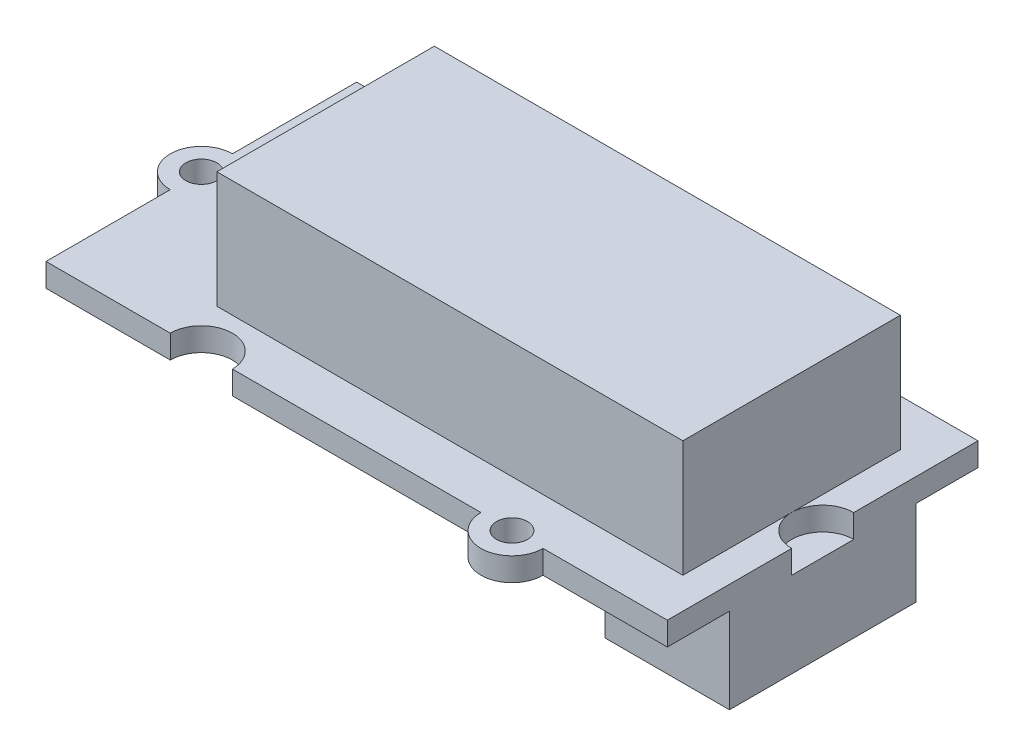
ISO-10303-21;
HEADER;
FILE_DESCRIPTION(('STEP AP214'),'2;1');
FILE_NAME('part.step','',(''),(''),'','','');
FILE_SCHEMA(('AUTOMOTIVE_DESIGN { 1 0 10303 214 1 1 1 1 }'));
ENDSEC;
DATA;
#1=APPLICATION_CONTEXT('core data for automotive mechanical design processes');
#2=APPLICATION_PROTOCOL_DEFINITION('international standard','automotive_design',2000,#1);
#3=PRODUCT_CONTEXT('',#1,'mechanical');
#4=PRODUCT('Part','Part','',(#3));
#5=PRODUCT_RELATED_PRODUCT_CATEGORY('part','',(#4));
#6=PRODUCT_DEFINITION_FORMATION('','',#4);
#7=PRODUCT_DEFINITION_CONTEXT('part definition',#1,'design');
#8=PRODUCT_DEFINITION('design','',#6,#7);
#9=PRODUCT_DEFINITION_SHAPE('','',#8);
#10=(LENGTH_UNIT() NAMED_UNIT(*) SI_UNIT(.MILLI.,.METRE.));
#11=(NAMED_UNIT(*) PLANE_ANGLE_UNIT() SI_UNIT($,.RADIAN.));
#12=(NAMED_UNIT(*) SI_UNIT($,.STERADIAN.) SOLID_ANGLE_UNIT());
#13=UNCERTAINTY_MEASURE_WITH_UNIT(LENGTH_MEASURE(1.E-05),#10,'distance_accuracy_value','');
#14=(GEOMETRIC_REPRESENTATION_CONTEXT(3) GLOBAL_UNCERTAINTY_ASSIGNED_CONTEXT((#13)) GLOBAL_UNIT_ASSIGNED_CONTEXT((#10,
#11,#12)) REPRESENTATION_CONTEXT('',''));
#15=CARTESIAN_POINT('',(0.,0.,0.));
#16=DIRECTION('',(0.,0.,1.));
#17=DIRECTION('',(1.,0.,0.));
#18=AXIS2_PLACEMENT_3D('',#15,#16,#17);
#19=CARTESIAN_POINT('',(20.,0.,0.));
#20=DIRECTION('',(0.,1.,0.));
#21=DIRECTION('',(0.,0.,1.));
#22=AXIS2_PLACEMENT_3D('',#19,#20,#21);
#23=PLANE('',#22);
#24=CARTESIAN_POINT('',(10.,0.,-10.));
#25=DIRECTION('',(0.,1.,0.));
#26=DIRECTION('',(0.,0.,1.));
#27=AXIS2_PLACEMENT_3D('',#24,#25,#26);
#28=CIRCLE('',#27,1.);
#29=CARTESIAN_POINT('',(10.,0.,-9.));
#30=VERTEX_POINT('',#29);
#31=EDGE_CURVE('E278',#30,#30,#28,.T.);
#32=ORIENTED_EDGE('',*,*,#31,.T.);
#33=EDGE_LOOP('',(#32));
#34=FACE_BOUND('',#33,.T.);
#35=CARTESIAN_POINT('',(10.,0.,10.));
#36=DIRECTION('',(0.,1.,0.));
#37=DIRECTION('',(0.,0.,1.));
#38=AXIS2_PLACEMENT_3D('',#35,#36,#37);
#39=CIRCLE('',#38,1.);
#40=CARTESIAN_POINT('',(10.,0.,11.));
#41=VERTEX_POINT('',#40);
#42=EDGE_CURVE('E283',#41,#41,#39,.T.);
#43=ORIENTED_EDGE('',*,*,#42,.T.);
#44=EDGE_LOOP('',(#43));
#45=FACE_BOUND('',#44,.T.);
#46=CARTESIAN_POINT('',(-20.,0.,0.));
#47=DIRECTION('',(0.,1.,0.));
#48=DIRECTION('',(0.,0.,1.));
#49=AXIS2_PLACEMENT_3D('',#46,#47,#48);
#50=CIRCLE('',#49,1.);
#51=CARTESIAN_POINT('',(-20.,0.,1.));
#52=VERTEX_POINT('',#51);
#53=EDGE_CURVE('E291',#52,#52,#50,.T.);
#54=ORIENTED_EDGE('',*,*,#53,.T.);
#55=EDGE_LOOP('',(#54));
#56=FACE_BOUND('',#55,.T.);
#57=DIRECTION('',(-1.,0.,0.));
#58=VECTOR('',#57,1.);
#59=CARTESIAN_POINT('',(12.,0.,6.));
#60=LINE('',#59,#58);
#61=CARTESIAN_POINT('',(20.,0.,6.));
#62=VERTEX_POINT('',#61);
#63=CARTESIAN_POINT('',(12.,0.,6.));
#64=VERTEX_POINT('',#63);
#65=EDGE_CURVE('E225',#62,#64,#60,.T.);
#66=ORIENTED_EDGE('',*,*,#65,.F.);
#67=DIRECTION('',(0.,0.,-1.));
#68=VECTOR('',#67,1.);
#69=CARTESIAN_POINT('',(20.,0.,2.));
#70=LINE('',#69,#68);
#71=CARTESIAN_POINT('',(20.,0.,10.));
#72=VERTEX_POINT('',#71);
#73=EDGE_CURVE('E359',#72,#62,#70,.T.);
#74=ORIENTED_EDGE('',*,*,#73,.F.);
#75=DIRECTION('',(1.,0.,0.));
#76=VECTOR('',#75,1.);
#77=CARTESIAN_POINT('',(12.,0.,10.));
#78=LINE('',#77,#76);
#79=CARTESIAN_POINT('',(12.,0.,10.));
#80=VERTEX_POINT('',#79);
#81=EDGE_CURVE('E299',#80,#72,#78,.T.);
#82=ORIENTED_EDGE('',*,*,#81,.F.);
#83=CARTESIAN_POINT('',(10.,0.,10.));
#84=DIRECTION('',(0.,1.,0.));
#85=DIRECTION('',(0.,0.,1.));
#86=AXIS2_PLACEMENT_3D('',#83,#84,#85);
#87=CIRCLE('',#86,2.);
#88=CARTESIAN_POINT('',(8.00000000000001,0.,10.));
#89=VERTEX_POINT('',#88);
#90=EDGE_CURVE('E308',#89,#80,#87,.T.);
#91=ORIENTED_EDGE('',*,*,#90,.F.);
#92=DIRECTION('',(1.,0.,0.));
#93=VECTOR('',#92,1.);
#94=CARTESIAN_POINT('',(-7.99999999999999,0.,10.));
#95=LINE('',#94,#93);
#96=CARTESIAN_POINT('',(-7.99999999999999,0.,10.));
#97=VERTEX_POINT('',#96);
#98=EDGE_CURVE('E399',#97,#89,#95,.T.);
#99=ORIENTED_EDGE('',*,*,#98,.F.);
#100=CARTESIAN_POINT('',(-9.99999999999999,0.,10.));
#101=DIRECTION('',(0.,-1.,0.));
#102=DIRECTION('',(0.,0.,1.));
#103=AXIS2_PLACEMENT_3D('',#100,#101,#102);
#104=CIRCLE('',#103,2.);
#105=CARTESIAN_POINT('',(-12.,0.,10.));
#106=VERTEX_POINT('',#105);
#107=EDGE_CURVE('E396',#106,#97,#104,.T.);
#108=ORIENTED_EDGE('',*,*,#107,.F.);
#109=DIRECTION('',(1.,0.,0.));
#110=VECTOR('',#109,1.);
#111=CARTESIAN_POINT('',(-20.,0.,10.));
#112=LINE('',#111,#110);
#113=CARTESIAN_POINT('',(-20.,0.,10.));
#114=VERTEX_POINT('',#113);
#115=EDGE_CURVE('E393',#114,#106,#112,.T.);
#116=ORIENTED_EDGE('',*,*,#115,.F.);
#117=DIRECTION('',(0.,0.,1.));
#118=VECTOR('',#117,1.);
#119=CARTESIAN_POINT('',(-20.,0.,2.));
#120=LINE('',#119,#118);
#121=CARTESIAN_POINT('',(-20.,0.,2.));
#122=VERTEX_POINT('',#121);
#123=EDGE_CURVE('E390',#122,#114,#120,.T.);
#124=ORIENTED_EDGE('',*,*,#123,.F.);
#125=CARTESIAN_POINT('',(-20.,0.,0.));
#126=DIRECTION('',(0.,1.,0.));
#127=DIRECTION('',(0.,0.,1.));
#128=AXIS2_PLACEMENT_3D('',#125,#126,#127);
#129=CIRCLE('',#128,2.);
#130=CARTESIAN_POINT('',(-20.,0.,-2.));
#131=VERTEX_POINT('',#130);
#132=EDGE_CURVE('E387',#131,#122,#129,.T.);
#133=ORIENTED_EDGE('',*,*,#132,.F.);
#134=DIRECTION('',(0.,0.,1.));
#135=VECTOR('',#134,1.);
#136=CARTESIAN_POINT('',(-20.,0.,-10.));
#137=LINE('',#136,#135);
#138=CARTESIAN_POINT('',(-20.,0.,-10.));
#139=VERTEX_POINT('',#138);
#140=EDGE_CURVE('E384',#139,#131,#137,.T.);
#141=ORIENTED_EDGE('',*,*,#140,.F.);
#142=DIRECTION('',(-1.,0.,0.));
#143=VECTOR('',#142,1.);
#144=CARTESIAN_POINT('',(-20.,0.,-10.));
#145=LINE('',#144,#143);
#146=CARTESIAN_POINT('',(-12.,0.,-10.));
#147=VERTEX_POINT('',#146);
#148=EDGE_CURVE('E381',#147,#139,#145,.T.);
#149=ORIENTED_EDGE('',*,*,#148,.F.);
#150=CARTESIAN_POINT('',(-9.99999999999999,0.,-10.));
#151=DIRECTION('',(0.,-1.,0.));
#152=DIRECTION('',(0.,0.,1.));
#153=AXIS2_PLACEMENT_3D('',#150,#151,#152);
#154=CIRCLE('',#153,2.);
#155=CARTESIAN_POINT('',(-7.99999999999999,0.,-10.));
#156=VERTEX_POINT('',#155);
#157=EDGE_CURVE('E378',#156,#147,#154,.T.);
#158=ORIENTED_EDGE('',*,*,#157,.F.);
#159=DIRECTION('',(-1.,0.,0.));
#160=VECTOR('',#159,1.);
#161=CARTESIAN_POINT('',(-7.99999999999999,0.,-10.));
#162=LINE('',#161,#160);
#163=CARTESIAN_POINT('',(8.00000000000001,0.,-10.));
#164=VERTEX_POINT('',#163);
#165=EDGE_CURVE('E375',#164,#156,#162,.T.);
#166=ORIENTED_EDGE('',*,*,#165,.F.);
#167=CARTESIAN_POINT('',(10.,0.,-10.));
#168=DIRECTION('',(0.,1.,0.));
#169=DIRECTION('',(0.,0.,1.));
#170=AXIS2_PLACEMENT_3D('',#167,#168,#169);
#171=CIRCLE('',#170,2.);
#172=CARTESIAN_POINT('',(12.,0.,-10.));
#173=VERTEX_POINT('',#172);
#174=EDGE_CURVE('E372',#173,#164,#171,.T.);
#175=ORIENTED_EDGE('',*,*,#174,.F.);
#176=DIRECTION('',(-1.,0.,0.));
#177=VECTOR('',#176,1.);
#178=CARTESIAN_POINT('',(12.,0.,-10.));
#179=LINE('',#178,#177);
#180=CARTESIAN_POINT('',(20.,0.,-10.));
#181=VERTEX_POINT('',#180);
#182=EDGE_CURVE('E369',#181,#173,#179,.T.);
#183=ORIENTED_EDGE('',*,*,#182,.F.);
#184=DIRECTION('',(0.,0.,-1.));
#185=VECTOR('',#184,1.);
#186=CARTESIAN_POINT('',(20.,0.,-10.));
#187=LINE('',#186,#185);
#188=CARTESIAN_POINT('',(20.,0.,-6.));
#189=VERTEX_POINT('',#188);
#190=EDGE_CURVE('E366',#189,#181,#187,.T.);
#191=ORIENTED_EDGE('',*,*,#190,.F.);
#192=DIRECTION('',(1.,0.,0.));
#193=VECTOR('',#192,1.);
#194=CARTESIAN_POINT('',(12.,0.,-6.));
#195=LINE('',#194,#193);
#196=CARTESIAN_POINT('',(12.,0.,-6.));
#197=VERTEX_POINT('',#196);
#198=EDGE_CURVE('E62',#197,#189,#195,.T.);
#199=ORIENTED_EDGE('',*,*,#198,.F.);
#200=DIRECTION('',(0.,0.,-1.));
#201=VECTOR('',#200,1.);
#202=CARTESIAN_POINT('',(12.,0.,6.));
#203=LINE('',#202,#201);
#204=EDGE_CURVE('E57',#64,#197,#203,.T.);
#205=ORIENTED_EDGE('',*,*,#204,.F.);
#206=EDGE_LOOP('',(#66,#74,#82,#91,#99,#108,#116,#124,#133,#141,#149,#158,#166,#175,#183,#191,
#199,#205));
#207=FACE_BOUND('',#206,.T.);
#208=ADVANCED_FACE('F39',(#34,#45,#56,#207),#23,.F.);
#209=CARTESIAN_POINT('',(20.,1.5,0.));
#210=DIRECTION('',(0.,1.,0.));
#211=DIRECTION('',(0.,0.,1.));
#212=AXIS2_PLACEMENT_3D('',#209,#210,#211);
#213=PLANE('',#212);
#214=DIRECTION('',(0.,0.,-1.));
#215=VECTOR('',#214,1.);
#216=CARTESIAN_POINT('',(18.,1.5,-7.));
#217=LINE('',#216,#215);
#218=CARTESIAN_POINT('',(18.,1.5,7.));
#219=VERTEX_POINT('',#218);
#220=CARTESIAN_POINT('',(18.,1.5,0.));
#221=VERTEX_POINT('',#220);
#222=EDGE_CURVE('E50',#219,#221,#217,.T.);
#223=ORIENTED_EDGE('',*,*,#222,.F.);
#224=DIRECTION('',(1.,0.,0.));
#225=VECTOR('',#224,1.);
#226=CARTESIAN_POINT('',(18.,1.5,7.));
#227=LINE('',#226,#225);
#228=CARTESIAN_POINT('',(-12.,1.5,7.));
#229=VERTEX_POINT('',#228);
#230=EDGE_CURVE('E243',#229,#219,#227,.T.);
#231=ORIENTED_EDGE('',*,*,#230,.F.);
#232=DIRECTION('',(0.,0.,1.));
#233=VECTOR('',#232,1.);
#234=CARTESIAN_POINT('',(-12.,1.5,-7.));
#235=LINE('',#234,#233);
#236=CARTESIAN_POINT('',(-12.,1.5,-7.));
#237=VERTEX_POINT('',#236);
#238=EDGE_CURVE('E256',#237,#229,#235,.T.);
#239=ORIENTED_EDGE('',*,*,#238,.F.);
#240=DIRECTION('',(-1.,0.,0.));
#241=VECTOR('',#240,1.);
#242=CARTESIAN_POINT('',(18.,1.5,-7.));
#243=LINE('',#242,#241);
#244=CARTESIAN_POINT('',(18.,1.5,-7.));
#245=VERTEX_POINT('',#244);
#246=EDGE_CURVE('E233',#245,#237,#243,.T.);
#247=ORIENTED_EDGE('',*,*,#246,.F.);
#248=EDGE_CURVE('E11',#221,#245,#217,.T.);
#249=ORIENTED_EDGE('',*,*,#248,.F.);
#250=CARTESIAN_POINT('',(20.,1.5,0.));
#251=DIRECTION('',(0.,-1.,0.));
#252=DIRECTION('',(0.,0.,1.));
#253=AXIS2_PLACEMENT_3D('',#250,#251,#252);
#254=CIRCLE('',#253,2.);
#255=CARTESIAN_POINT('',(20.,1.5,-2.));
#256=VERTEX_POINT('',#255);
#257=EDGE_CURVE('E311',#221,#256,#254,.T.);
#258=ORIENTED_EDGE('',*,*,#257,.T.);
#259=DIRECTION('',(0.,0.,-1.));
#260=VECTOR('',#259,1.);
#261=CARTESIAN_POINT('',(20.,1.5,-10.));
#262=LINE('',#261,#260);
#263=CARTESIAN_POINT('',(20.,1.5,-10.));
#264=VERTEX_POINT('',#263);
#265=EDGE_CURVE('E316',#256,#264,#262,.T.);
#266=ORIENTED_EDGE('',*,*,#265,.T.);
#267=DIRECTION('',(-1.,0.,0.));
#268=VECTOR('',#267,1.);
#269=CARTESIAN_POINT('',(12.,1.5,-10.));
#270=LINE('',#269,#268);
#271=CARTESIAN_POINT('',(12.,1.5,-10.));
#272=VERTEX_POINT('',#271);
#273=EDGE_CURVE('E319',#264,#272,#270,.T.);
#274=ORIENTED_EDGE('',*,*,#273,.T.);
#275=CARTESIAN_POINT('',(10.,1.5,-10.));
#276=DIRECTION('',(0.,1.,0.));
#277=DIRECTION('',(0.,0.,1.));
#278=AXIS2_PLACEMENT_3D('',#275,#276,#277);
#279=CIRCLE('',#278,2.);
#280=CARTESIAN_POINT('',(8.00000000000001,1.5,-10.));
#281=VERTEX_POINT('',#280);
#282=EDGE_CURVE('E322',#272,#281,#279,.T.);
#283=ORIENTED_EDGE('',*,*,#282,.T.);
#284=DIRECTION('',(-1.,0.,0.));
#285=VECTOR('',#284,1.);
#286=CARTESIAN_POINT('',(-7.99999999999999,1.5,-10.));
#287=LINE('',#286,#285);
#288=CARTESIAN_POINT('',(-7.99999999999999,1.5,-10.));
#289=VERTEX_POINT('',#288);
#290=EDGE_CURVE('E325',#281,#289,#287,.T.);
#291=ORIENTED_EDGE('',*,*,#290,.T.);
#292=CARTESIAN_POINT('',(-9.99999999999999,1.5,-10.));
#293=DIRECTION('',(0.,-1.,0.));
#294=DIRECTION('',(0.,0.,1.));
#295=AXIS2_PLACEMENT_3D('',#292,#293,#294);
#296=CIRCLE('',#295,2.);
#297=CARTESIAN_POINT('',(-12.,1.5,-10.));
#298=VERTEX_POINT('',#297);
#299=EDGE_CURVE('E328',#289,#298,#296,.T.);
#300=ORIENTED_EDGE('',*,*,#299,.T.);
#301=DIRECTION('',(-1.,0.,0.));
#302=VECTOR('',#301,1.);
#303=CARTESIAN_POINT('',(-20.,1.5,-10.));
#304=LINE('',#303,#302);
#305=CARTESIAN_POINT('',(-20.,1.5,-10.));
#306=VERTEX_POINT('',#305);
#307=EDGE_CURVE('E331',#298,#306,#304,.T.);
#308=ORIENTED_EDGE('',*,*,#307,.T.);
#309=DIRECTION('',(0.,0.,1.));
#310=VECTOR('',#309,1.);
#311=CARTESIAN_POINT('',(-20.,1.5,-10.));
#312=LINE('',#311,#310);
#313=CARTESIAN_POINT('',(-20.,1.5,-2.));
#314=VERTEX_POINT('',#313);
#315=EDGE_CURVE('E334',#306,#314,#312,.T.);
#316=ORIENTED_EDGE('',*,*,#315,.T.);
#317=CARTESIAN_POINT('',(-20.,1.5,0.));
#318=DIRECTION('',(0.,1.,0.));
#319=DIRECTION('',(0.,0.,1.));
#320=AXIS2_PLACEMENT_3D('',#317,#318,#319);
#321=CIRCLE('',#320,2.);
#322=CARTESIAN_POINT('',(-20.,1.5,2.));
#323=VERTEX_POINT('',#322);
#324=EDGE_CURVE('E337',#314,#323,#321,.T.);
#325=ORIENTED_EDGE('',*,*,#324,.T.);
#326=DIRECTION('',(0.,0.,1.));
#327=VECTOR('',#326,1.);
#328=CARTESIAN_POINT('',(-20.,1.5,2.));
#329=LINE('',#328,#327);
#330=CARTESIAN_POINT('',(-20.,1.5,10.));
#331=VERTEX_POINT('',#330);
#332=EDGE_CURVE('E340',#323,#331,#329,.T.);
#333=ORIENTED_EDGE('',*,*,#332,.T.);
#334=DIRECTION('',(1.,0.,0.));
#335=VECTOR('',#334,1.);
#336=CARTESIAN_POINT('',(-20.,1.5,10.));
#337=LINE('',#336,#335);
#338=CARTESIAN_POINT('',(-12.,1.5,10.));
#339=VERTEX_POINT('',#338);
#340=EDGE_CURVE('E343',#331,#339,#337,.T.);
#341=ORIENTED_EDGE('',*,*,#340,.T.);
#342=CARTESIAN_POINT('',(-9.99999999999999,1.5,10.));
#343=DIRECTION('',(0.,-1.,0.));
#344=DIRECTION('',(0.,0.,1.));
#345=AXIS2_PLACEMENT_3D('',#342,#343,#344);
#346=CIRCLE('',#345,2.);
#347=CARTESIAN_POINT('',(-7.99999999999999,1.5,10.));
#348=VERTEX_POINT('',#347);
#349=EDGE_CURVE('E346',#339,#348,#346,.T.);
#350=ORIENTED_EDGE('',*,*,#349,.T.);
#351=DIRECTION('',(1.,0.,0.));
#352=VECTOR('',#351,1.);
#353=CARTESIAN_POINT('',(-7.99999999999999,1.5,10.));
#354=LINE('',#353,#352);
#355=CARTESIAN_POINT('',(8.00000000000001,1.5,10.));
#356=VERTEX_POINT('',#355);
#357=EDGE_CURVE('E349',#348,#356,#354,.T.);
#358=ORIENTED_EDGE('',*,*,#357,.T.);
#359=CARTESIAN_POINT('',(10.,1.5,10.));
#360=DIRECTION('',(0.,1.,0.));
#361=DIRECTION('',(0.,0.,1.));
#362=AXIS2_PLACEMENT_3D('',#359,#360,#361);
#363=CIRCLE('',#362,2.);
#364=CARTESIAN_POINT('',(12.,1.5,10.));
#365=VERTEX_POINT('',#364);
#366=EDGE_CURVE('E352',#356,#365,#363,.T.);
#367=ORIENTED_EDGE('',*,*,#366,.T.);
#368=DIRECTION('',(1.,0.,0.));
#369=VECTOR('',#368,1.);
#370=CARTESIAN_POINT('',(12.,1.5,10.));
#371=LINE('',#370,#369);
#372=CARTESIAN_POINT('',(20.,1.5,10.));
#373=VERTEX_POINT('',#372);
#374=EDGE_CURVE('E303',#365,#373,#371,.T.);
#375=ORIENTED_EDGE('',*,*,#374,.T.);
#376=DIRECTION('',(0.,0.,-1.));
#377=VECTOR('',#376,1.);
#378=CARTESIAN_POINT('',(20.,1.5,2.));
#379=LINE('',#378,#377);
#380=CARTESIAN_POINT('',(20.,1.5,2.));
#381=VERTEX_POINT('',#380);
#382=EDGE_CURVE('E307',#373,#381,#379,.T.);
#383=ORIENTED_EDGE('',*,*,#382,.T.);
#384=EDGE_CURVE('E312',#381,#221,#254,.T.);
#385=ORIENTED_EDGE('',*,*,#384,.T.);
#386=EDGE_LOOP('',(#223,#231,#239,#247,#249,#258,#266,#274,#283,#291,#300,#308,#316,#325,#333,
#341,#350,#358,#367,#375,#383,#385));
#387=FACE_BOUND('',#386,.T.);
#388=CARTESIAN_POINT('',(10.,1.5,10.));
#389=DIRECTION('',(0.,1.,0.));
#390=DIRECTION('',(0.,0.,1.));
#391=AXIS2_PLACEMENT_3D('',#388,#389,#390);
#392=CIRCLE('',#391,1.);
#393=CARTESIAN_POINT('',(10.,1.5,11.));
#394=VERTEX_POINT('',#393);
#395=EDGE_CURVE('E287',#394,#394,#392,.T.);
#396=ORIENTED_EDGE('',*,*,#395,.F.);
#397=EDGE_LOOP('',(#396));
#398=FACE_BOUND('',#397,.T.);
#399=CARTESIAN_POINT('',(-20.,1.5,0.));
#400=DIRECTION('',(0.,1.,0.));
#401=DIRECTION('',(0.,0.,1.));
#402=AXIS2_PLACEMENT_3D('',#399,#400,#401);
#403=CIRCLE('',#402,1.);
#404=CARTESIAN_POINT('',(-20.,1.5,1.));
#405=VERTEX_POINT('',#404);
#406=EDGE_CURVE('E295',#405,#405,#403,.T.);
#407=ORIENTED_EDGE('',*,*,#406,.F.);
#408=EDGE_LOOP('',(#407));
#409=FACE_BOUND('',#408,.T.);
#410=CARTESIAN_POINT('',(10.,1.5,-10.));
#411=DIRECTION('',(0.,1.,0.));
#412=DIRECTION('',(0.,0.,1.));
#413=AXIS2_PLACEMENT_3D('',#410,#411,#412);
#414=CIRCLE('',#413,1.);
#415=CARTESIAN_POINT('',(10.,1.5,-9.));
#416=VERTEX_POINT('',#415);
#417=EDGE_CURVE('E279',#416,#416,#414,.T.);
#418=ORIENTED_EDGE('',*,*,#417,.F.);
#419=EDGE_LOOP('',(#418));
#420=FACE_BOUND('',#419,.T.);
#421=ADVANCED_FACE('F517',(#387,#398,#409,#420),#213,.T.);
#422=CARTESIAN_POINT('',(12.,1.5,10.));
#423=DIRECTION('',(0.,0.,-1.));
#424=DIRECTION('',(-1.,0.,0.));
#425=AXIS2_PLACEMENT_3D('',#422,#423,#424);
#426=PLANE('',#425);
#427=ORIENTED_EDGE('',*,*,#81,.T.);
#428=DIRECTION('',(0.,-1.,0.));
#429=VECTOR('',#428,1.);
#430=CARTESIAN_POINT('',(20.,1.5,10.));
#431=LINE('',#430,#429);
#432=EDGE_CURVE('E43',#373,#72,#431,.T.);
#433=ORIENTED_EDGE('',*,*,#432,.F.);
#434=ORIENTED_EDGE('',*,*,#374,.F.);
#435=DIRECTION('',(0.,-1.,0.));
#436=VECTOR('',#435,1.);
#437=CARTESIAN_POINT('',(12.,1.5,10.));
#438=LINE('',#437,#436);
#439=EDGE_CURVE('E355',#365,#80,#438,.T.);
#440=ORIENTED_EDGE('',*,*,#439,.T.);
#441=EDGE_LOOP('',(#427,#433,#434,#440));
#442=FACE_BOUND('',#441,.T.);
#443=ADVANCED_FACE('F41',(#442),#426,.F.);
#444=CARTESIAN_POINT('',(20.,1.5,0.));
#445=DIRECTION('',(0.,-1.,0.));
#446=DIRECTION('',(0.,0.,-1.));
#447=AXIS2_PLACEMENT_3D('',#444,#445,#446);
#448=CYLINDRICAL_SURFACE('',#447,2.);
#449=CARTESIAN_POINT('',(20.,0.,0.));
#450=DIRECTION('',(0.,-1.,0.));
#451=DIRECTION('',(0.,0.,1.));
#452=AXIS2_PLACEMENT_3D('',#449,#450,#451);
#453=CIRCLE('',#452,2.);
#454=CARTESIAN_POINT('',(20.,0.,2.));
#455=VERTEX_POINT('',#454);
#456=CARTESIAN_POINT('',(20.,0.,-2.));
#457=VERTEX_POINT('',#456);
#458=EDGE_CURVE('E363',#455,#457,#453,.T.);
#459=ORIENTED_EDGE('',*,*,#458,.T.);
#460=DIRECTION('',(0.,-1.,0.));
#461=VECTOR('',#460,1.);
#462=CARTESIAN_POINT('',(20.,1.5,-2.));
#463=LINE('',#462,#461);
#464=EDGE_CURVE('E455',#256,#457,#463,.T.);
#465=ORIENTED_EDGE('',*,*,#464,.F.);
#466=ORIENTED_EDGE('',*,*,#257,.F.);
#467=ORIENTED_EDGE('',*,*,#384,.F.);
#468=DIRECTION('',(0.,-1.,0.));
#469=VECTOR('',#468,1.);
#470=CARTESIAN_POINT('',(20.,1.5,2.));
#471=LINE('',#470,#469);
#472=EDGE_CURVE('E458',#381,#455,#471,.T.);
#473=ORIENTED_EDGE('',*,*,#472,.T.);
#474=EDGE_LOOP('',(#459,#465,#466,#467,#473));
#475=FACE_BOUND('',#474,.T.);
#476=ADVANCED_FACE('F525',(#475),#448,.F.);
#477=CARTESIAN_POINT('',(20.,1.5,-10.));
#478=DIRECTION('',(-1.,0.,0.));
#479=DIRECTION('',(0.,0.,1.));
#480=AXIS2_PLACEMENT_3D('',#477,#478,#479);
#481=PLANE('',#480);
#482=ORIENTED_EDGE('',*,*,#464,.T.);
#483=DIRECTION('',(0.,0.,1.));
#484=VECTOR('',#483,1.);
#485=CARTESIAN_POINT('',(20.,0.,6.));
#486=LINE('',#485,#484);
#487=EDGE_CURVE('E479',#457,#455,#486,.T.);
#488=ORIENTED_EDGE('',*,*,#487,.T.);
#489=ORIENTED_EDGE('',*,*,#472,.F.);
#490=ORIENTED_EDGE('',*,*,#382,.F.);
#491=ORIENTED_EDGE('',*,*,#432,.T.);
#492=ORIENTED_EDGE('',*,*,#73,.T.);
#493=DIRECTION('',(0.,1.,0.));
#494=VECTOR('',#493,1.);
#495=CARTESIAN_POINT('',(20.,-5.5,6.));
#496=LINE('',#495,#494);
#497=CARTESIAN_POINT('',(20.,-5.5,6.));
#498=VERTEX_POINT('',#497);
#499=EDGE_CURVE('E234',#498,#62,#496,.T.);
#500=ORIENTED_EDGE('',*,*,#499,.F.);
#501=DIRECTION('',(0.,0.,1.));
#502=VECTOR('',#501,1.);
#503=CARTESIAN_POINT('',(20.,-5.5,6.));
#504=LINE('',#503,#502);
#505=CARTESIAN_POINT('',(20.,-5.5,-6.));
#506=VERTEX_POINT('',#505);
#507=EDGE_CURVE('E214',#506,#498,#504,.T.);
#508=ORIENTED_EDGE('',*,*,#507,.F.);
#509=DIRECTION('',(0.,1.,0.));
#510=VECTOR('',#509,1.);
#511=CARTESIAN_POINT('',(20.,-5.5,-6.));
#512=LINE('',#511,#510);
#513=EDGE_CURVE('E210',#506,#189,#512,.T.);
#514=ORIENTED_EDGE('',*,*,#513,.T.);
#515=ORIENTED_EDGE('',*,*,#190,.T.);
#516=DIRECTION('',(0.,-1.,0.));
#517=VECTOR('',#516,1.);
#518=CARTESIAN_POINT('',(20.,1.5,-10.));
#519=LINE('',#518,#517);
#520=EDGE_CURVE('E451',#264,#181,#519,.T.);
#521=ORIENTED_EDGE('',*,*,#520,.F.);
#522=ORIENTED_EDGE('',*,*,#265,.F.);
#523=EDGE_LOOP('',(#482,#488,#489,#490,#491,#492,#500,#508,#514,#515,#521,#522));
#524=FACE_BOUND('',#523,.T.);
#525=ADVANCED_FACE('F468',(#524),#481,.F.);
#526=CARTESIAN_POINT('',(12.,1.5,-10.));
#527=DIRECTION('',(0.,0.,1.));
#528=DIRECTION('',(1.,0.,0.));
#529=AXIS2_PLACEMENT_3D('',#526,#527,#528);
#530=PLANE('',#529);
#531=ORIENTED_EDGE('',*,*,#182,.T.);
#532=DIRECTION('',(0.,-1.,0.));
#533=VECTOR('',#532,1.);
#534=CARTESIAN_POINT('',(12.,1.5,-10.));
#535=LINE('',#534,#533);
#536=EDGE_CURVE('E447',#272,#173,#535,.T.);
#537=ORIENTED_EDGE('',*,*,#536,.F.);
#538=ORIENTED_EDGE('',*,*,#273,.F.);
#539=ORIENTED_EDGE('',*,*,#520,.T.);
#540=EDGE_LOOP('',(#531,#537,#538,#539));
#541=FACE_BOUND('',#540,.T.);
#542=ADVANCED_FACE('F502',(#541),#530,.F.);
#543=CARTESIAN_POINT('',(10.,1.5,-10.));
#544=DIRECTION('',(0.,-1.,0.));
#545=DIRECTION('',(0.,0.,-1.));
#546=AXIS2_PLACEMENT_3D('',#543,#544,#545);
#547=CYLINDRICAL_SURFACE('',#546,2.);
#548=ORIENTED_EDGE('',*,*,#174,.T.);
#549=DIRECTION('',(0.,-1.,0.));
#550=VECTOR('',#549,1.);
#551=CARTESIAN_POINT('',(8.00000000000001,1.5,-10.));
#552=LINE('',#551,#550);
#553=EDGE_CURVE('E443',#281,#164,#552,.T.);
#554=ORIENTED_EDGE('',*,*,#553,.F.);
#555=ORIENTED_EDGE('',*,*,#282,.F.);
#556=ORIENTED_EDGE('',*,*,#536,.T.);
#557=EDGE_LOOP('',(#548,#554,#555,#556));
#558=FACE_BOUND('',#557,.T.);
#559=ADVANCED_FACE('F509',(#558),#547,.T.);
#560=CARTESIAN_POINT('',(-7.99999999999999,1.5,-10.));
#561=DIRECTION('',(0.,0.,1.));
#562=DIRECTION('',(1.,0.,0.));
#563=AXIS2_PLACEMENT_3D('',#560,#561,#562);
#564=PLANE('',#563);
#565=ORIENTED_EDGE('',*,*,#165,.T.);
#566=DIRECTION('',(0.,-1.,0.));
#567=VECTOR('',#566,1.);
#568=CARTESIAN_POINT('',(-7.99999999999999,1.5,-10.));
#569=LINE('',#568,#567);
#570=EDGE_CURVE('E439',#289,#156,#569,.T.);
#571=ORIENTED_EDGE('',*,*,#570,.F.);
#572=ORIENTED_EDGE('',*,*,#290,.F.);
#573=ORIENTED_EDGE('',*,*,#553,.T.);
#574=EDGE_LOOP('',(#565,#571,#572,#573));
#575=FACE_BOUND('',#574,.T.);
#576=ADVANCED_FACE('F513',(#575),#564,.F.);
#577=CARTESIAN_POINT('',(-9.99999999999999,1.5,-10.));
#578=DIRECTION('',(0.,-1.,0.));
#579=DIRECTION('',(0.,0.,-1.));
#580=AXIS2_PLACEMENT_3D('',#577,#578,#579);
#581=CYLINDRICAL_SURFACE('',#580,2.);
#582=ORIENTED_EDGE('',*,*,#157,.T.);
#583=DIRECTION('',(0.,-1.,0.));
#584=VECTOR('',#583,1.);
#585=CARTESIAN_POINT('',(-12.,1.5,-10.));
#586=LINE('',#585,#584);
#587=EDGE_CURVE('E435',#298,#147,#586,.T.);
#588=ORIENTED_EDGE('',*,*,#587,.F.);
#589=ORIENTED_EDGE('',*,*,#299,.F.);
#590=ORIENTED_EDGE('',*,*,#570,.T.);
#591=EDGE_LOOP('',(#582,#588,#589,#590));
#592=FACE_BOUND('',#591,.T.);
#593=ADVANCED_FACE('F574',(#592),#581,.F.);
#594=CARTESIAN_POINT('',(-20.,1.5,-10.));
#595=DIRECTION('',(0.,0.,1.));
#596=DIRECTION('',(1.,0.,0.));
#597=AXIS2_PLACEMENT_3D('',#594,#595,#596);
#598=PLANE('',#597);
#599=ORIENTED_EDGE('',*,*,#148,.T.);
#600=DIRECTION('',(0.,-1.,0.));
#601=VECTOR('',#600,1.);
#602=CARTESIAN_POINT('',(-20.,1.5,-10.));
#603=LINE('',#602,#601);
#604=EDGE_CURVE('E431',#306,#139,#603,.T.);
#605=ORIENTED_EDGE('',*,*,#604,.F.);
#606=ORIENTED_EDGE('',*,*,#307,.F.);
#607=ORIENTED_EDGE('',*,*,#587,.T.);
#608=EDGE_LOOP('',(#599,#605,#606,#607));
#609=FACE_BOUND('',#608,.T.);
#610=ADVANCED_FACE('F570',(#609),#598,.F.);
#611=CARTESIAN_POINT('',(-20.,1.5,-10.));
#612=DIRECTION('',(1.,0.,0.));
#613=DIRECTION('',(0.,0.,-1.));
#614=AXIS2_PLACEMENT_3D('',#611,#612,#613);
#615=PLANE('',#614);
#616=ORIENTED_EDGE('',*,*,#140,.T.);
#617=DIRECTION('',(0.,-1.,0.));
#618=VECTOR('',#617,1.);
#619=CARTESIAN_POINT('',(-20.,1.5,-2.));
#620=LINE('',#619,#618);
#621=EDGE_CURVE('E427',#314,#131,#620,.T.);
#622=ORIENTED_EDGE('',*,*,#621,.F.);
#623=ORIENTED_EDGE('',*,*,#315,.F.);
#624=ORIENTED_EDGE('',*,*,#604,.T.);
#625=EDGE_LOOP('',(#616,#622,#623,#624));
#626=FACE_BOUND('',#625,.T.);
#627=ADVANCED_FACE('F566',(#626),#615,.F.);
#628=CARTESIAN_POINT('',(-20.,1.5,0.));
#629=DIRECTION('',(0.,-1.,0.));
#630=DIRECTION('',(0.,0.,-1.));
#631=AXIS2_PLACEMENT_3D('',#628,#629,#630);
#632=CYLINDRICAL_SURFACE('',#631,2.);
#633=ORIENTED_EDGE('',*,*,#132,.T.);
#634=DIRECTION('',(0.,-1.,0.));
#635=VECTOR('',#634,1.);
#636=CARTESIAN_POINT('',(-20.,1.5,2.));
#637=LINE('',#636,#635);
#638=EDGE_CURVE('E423',#323,#122,#637,.T.);
#639=ORIENTED_EDGE('',*,*,#638,.F.);
#640=ORIENTED_EDGE('',*,*,#324,.F.);
#641=ORIENTED_EDGE('',*,*,#621,.T.);
#642=EDGE_LOOP('',(#633,#639,#640,#641));
#643=FACE_BOUND('',#642,.T.);
#644=ADVANCED_FACE('F562',(#643),#632,.T.);
#645=CARTESIAN_POINT('',(-20.,1.5,2.));
#646=DIRECTION('',(1.,0.,0.));
#647=DIRECTION('',(0.,0.,-1.));
#648=AXIS2_PLACEMENT_3D('',#645,#646,#647);
#649=PLANE('',#648);
#650=ORIENTED_EDGE('',*,*,#123,.T.);
#651=DIRECTION('',(0.,-1.,0.));
#652=VECTOR('',#651,1.);
#653=CARTESIAN_POINT('',(-20.,1.5,10.));
#654=LINE('',#653,#652);
#655=EDGE_CURVE('E419',#331,#114,#654,.T.);
#656=ORIENTED_EDGE('',*,*,#655,.F.);
#657=ORIENTED_EDGE('',*,*,#332,.F.);
#658=ORIENTED_EDGE('',*,*,#638,.T.);
#659=EDGE_LOOP('',(#650,#656,#657,#658));
#660=FACE_BOUND('',#659,.T.);
#661=ADVANCED_FACE('F558',(#660),#649,.F.);
#662=CARTESIAN_POINT('',(-20.,1.5,10.));
#663=DIRECTION('',(0.,0.,-1.));
#664=DIRECTION('',(-1.,0.,0.));
#665=AXIS2_PLACEMENT_3D('',#662,#663,#664);
#666=PLANE('',#665);
#667=ORIENTED_EDGE('',*,*,#115,.T.);
#668=DIRECTION('',(0.,-1.,0.));
#669=VECTOR('',#668,1.);
#670=CARTESIAN_POINT('',(-12.,1.5,10.));
#671=LINE('',#670,#669);
#672=EDGE_CURVE('E415',#339,#106,#671,.T.);
#673=ORIENTED_EDGE('',*,*,#672,.F.);
#674=ORIENTED_EDGE('',*,*,#340,.F.);
#675=ORIENTED_EDGE('',*,*,#655,.T.);
#676=EDGE_LOOP('',(#667,#673,#674,#675));
#677=FACE_BOUND('',#676,.T.);
#678=ADVANCED_FACE('F554',(#677),#666,.F.);
#679=CARTESIAN_POINT('',(-9.99999999999999,1.5,10.));
#680=DIRECTION('',(0.,-1.,0.));
#681=DIRECTION('',(0.,0.,-1.));
#682=AXIS2_PLACEMENT_3D('',#679,#680,#681);
#683=CYLINDRICAL_SURFACE('',#682,2.);
#684=ORIENTED_EDGE('',*,*,#107,.T.);
#685=DIRECTION('',(0.,-1.,0.));
#686=VECTOR('',#685,1.);
#687=CARTESIAN_POINT('',(-7.99999999999999,1.5,10.));
#688=LINE('',#687,#686);
#689=EDGE_CURVE('E411',#348,#97,#688,.T.);
#690=ORIENTED_EDGE('',*,*,#689,.F.);
#691=ORIENTED_EDGE('',*,*,#349,.F.);
#692=ORIENTED_EDGE('',*,*,#672,.T.);
#693=EDGE_LOOP('',(#684,#690,#691,#692));
#694=FACE_BOUND('',#693,.T.);
#695=ADVANCED_FACE('F550',(#694),#683,.F.);
#696=CARTESIAN_POINT('',(-7.99999999999999,1.5,10.));
#697=DIRECTION('',(0.,0.,-1.));
#698=DIRECTION('',(-1.,0.,0.));
#699=AXIS2_PLACEMENT_3D('',#696,#697,#698);
#700=PLANE('',#699);
#701=ORIENTED_EDGE('',*,*,#98,.T.);
#702=DIRECTION('',(0.,-1.,0.));
#703=VECTOR('',#702,1.);
#704=CARTESIAN_POINT('',(8.00000000000001,1.5,10.));
#705=LINE('',#704,#703);
#706=EDGE_CURVE('E407',#356,#89,#705,.T.);
#707=ORIENTED_EDGE('',*,*,#706,.F.);
#708=ORIENTED_EDGE('',*,*,#357,.F.);
#709=ORIENTED_EDGE('',*,*,#689,.T.);
#710=EDGE_LOOP('',(#701,#707,#708,#709));
#711=FACE_BOUND('',#710,.T.);
#712=ADVANCED_FACE('F546',(#711),#700,.F.);
#713=CARTESIAN_POINT('',(10.,1.5,10.));
#714=DIRECTION('',(0.,-1.,0.));
#715=DIRECTION('',(0.,0.,-1.));
#716=AXIS2_PLACEMENT_3D('',#713,#714,#715);
#717=CYLINDRICAL_SURFACE('',#716,2.);
#718=ORIENTED_EDGE('',*,*,#90,.T.);
#719=ORIENTED_EDGE('',*,*,#439,.F.);
#720=ORIENTED_EDGE('',*,*,#366,.F.);
#721=ORIENTED_EDGE('',*,*,#706,.T.);
#722=EDGE_LOOP('',(#718,#719,#720,#721));
#723=FACE_BOUND('',#722,.T.);
#724=ADVANCED_FACE('F542',(#723),#717,.T.);
#725=CARTESIAN_POINT('',(-20.,1.5,0.));
#726=DIRECTION('',(0.,-1.,0.));
#727=DIRECTION('',(0.,0.,-1.));
#728=AXIS2_PLACEMENT_3D('',#725,#726,#727);
#729=CYLINDRICAL_SURFACE('',#728,1.);
#730=ORIENTED_EDGE('',*,*,#406,.T.);
#731=EDGE_LOOP('',(#730));
#732=FACE_BOUND('',#731,.T.);
#733=ORIENTED_EDGE('',*,*,#53,.F.);
#734=EDGE_LOOP('',(#733));
#735=FACE_BOUND('',#734,.T.);
#736=ADVANCED_FACE('F545',(#732,#735),#729,.F.);
#737=CARTESIAN_POINT('',(10.,1.5,10.));
#738=DIRECTION('',(0.,-1.,0.));
#739=DIRECTION('',(0.,0.,-1.));
#740=AXIS2_PLACEMENT_3D('',#737,#738,#739);
#741=CYLINDRICAL_SURFACE('',#740,1.);
#742=ORIENTED_EDGE('',*,*,#395,.T.);
#743=EDGE_LOOP('',(#742));
#744=FACE_BOUND('',#743,.T.);
#745=ORIENTED_EDGE('',*,*,#42,.F.);
#746=EDGE_LOOP('',(#745));
#747=FACE_BOUND('',#746,.T.);
#748=ADVANCED_FACE('F639',(#744,#747),#741,.F.);
#749=CARTESIAN_POINT('',(10.,1.5,-10.));
#750=DIRECTION('',(0.,-1.,0.));
#751=DIRECTION('',(0.,0.,-1.));
#752=AXIS2_PLACEMENT_3D('',#749,#750,#751);
#753=CYLINDRICAL_SURFACE('',#752,1.);
#754=ORIENTED_EDGE('',*,*,#417,.T.);
#755=EDGE_LOOP('',(#754));
#756=FACE_BOUND('',#755,.T.);
#757=ORIENTED_EDGE('',*,*,#31,.F.);
#758=EDGE_LOOP('',(#757));
#759=FACE_BOUND('',#758,.T.);
#760=ADVANCED_FACE('F646',(#756,#759),#753,.F.);
#761=CARTESIAN_POINT('',(18.,9.,-7.));
#762=DIRECTION('',(-1.,0.,0.));
#763=DIRECTION('',(0.,0.,1.));
#764=AXIS2_PLACEMENT_3D('',#761,#762,#763);
#765=PLANE('',#764);
#766=ORIENTED_EDGE('',*,*,#222,.T.);
#767=ORIENTED_EDGE('',*,*,#248,.T.);
#768=DIRECTION('',(0.,-1.,0.));
#769=VECTOR('',#768,1.);
#770=CARTESIAN_POINT('',(18.,9.,-7.));
#771=LINE('',#770,#769);
#772=CARTESIAN_POINT('',(18.,9.,-7.));
#773=VERTEX_POINT('',#772);
#774=EDGE_CURVE('E274',#773,#245,#771,.T.);
#775=ORIENTED_EDGE('',*,*,#774,.F.);
#776=DIRECTION('',(0.,0.,-1.));
#777=VECTOR('',#776,1.);
#778=CARTESIAN_POINT('',(18.,9.,-7.));
#779=LINE('',#778,#777);
#780=CARTESIAN_POINT('',(18.,9.,7.));
#781=VERTEX_POINT('',#780);
#782=EDGE_CURVE('E238',#781,#773,#779,.T.);
#783=ORIENTED_EDGE('',*,*,#782,.F.);
#784=DIRECTION('',(0.,-1.,0.));
#785=VECTOR('',#784,1.);
#786=CARTESIAN_POINT('',(18.,9.,7.));
#787=LINE('',#786,#785);
#788=EDGE_CURVE('E251',#781,#219,#787,.T.);
#789=ORIENTED_EDGE('',*,*,#788,.T.);
#790=EDGE_LOOP('',(#766,#767,#775,#783,#789));
#791=FACE_BOUND('',#790,.T.);
#792=ADVANCED_FACE('F654',(#791),#765,.F.);
#793=CARTESIAN_POINT('',(18.,9.,-7.));
#794=DIRECTION('',(0.,0.,1.));
#795=DIRECTION('',(1.,0.,0.));
#796=AXIS2_PLACEMENT_3D('',#793,#794,#795);
#797=PLANE('',#796);
#798=ORIENTED_EDGE('',*,*,#246,.T.);
#799=DIRECTION('',(0.,-1.,0.));
#800=VECTOR('',#799,1.);
#801=CARTESIAN_POINT('',(-12.,9.,-7.));
#802=LINE('',#801,#800);
#803=CARTESIAN_POINT('',(-12.,9.,-7.));
#804=VERTEX_POINT('',#803);
#805=EDGE_CURVE('E270',#804,#237,#802,.T.);
#806=ORIENTED_EDGE('',*,*,#805,.F.);
#807=DIRECTION('',(-1.,0.,0.));
#808=VECTOR('',#807,1.);
#809=CARTESIAN_POINT('',(18.,9.,-7.));
#810=LINE('',#809,#808);
#811=EDGE_CURVE('E242',#773,#804,#810,.T.);
#812=ORIENTED_EDGE('',*,*,#811,.F.);
#813=ORIENTED_EDGE('',*,*,#774,.T.);
#814=EDGE_LOOP('',(#798,#806,#812,#813));
#815=FACE_BOUND('',#814,.T.);
#816=ADVANCED_FACE('F663',(#815),#797,.F.);
#817=CARTESIAN_POINT('',(-12.,9.,-7.));
#818=DIRECTION('',(1.,0.,0.));
#819=DIRECTION('',(0.,0.,-1.));
#820=AXIS2_PLACEMENT_3D('',#817,#818,#819);
#821=PLANE('',#820);
#822=ORIENTED_EDGE('',*,*,#238,.T.);
#823=DIRECTION('',(0.,-1.,0.));
#824=VECTOR('',#823,1.);
#825=CARTESIAN_POINT('',(-12.,9.,7.));
#826=LINE('',#825,#824);
#827=CARTESIAN_POINT('',(-12.,9.,7.));
#828=VERTEX_POINT('',#827);
#829=EDGE_CURVE('E266',#828,#229,#826,.T.);
#830=ORIENTED_EDGE('',*,*,#829,.F.);
#831=DIRECTION('',(0.,0.,1.));
#832=VECTOR('',#831,1.);
#833=CARTESIAN_POINT('',(-12.,9.,-7.));
#834=LINE('',#833,#832);
#835=EDGE_CURVE('E246',#804,#828,#834,.T.);
#836=ORIENTED_EDGE('',*,*,#835,.F.);
#837=ORIENTED_EDGE('',*,*,#805,.T.);
#838=EDGE_LOOP('',(#822,#830,#836,#837));
#839=FACE_BOUND('',#838,.T.);
#840=ADVANCED_FACE('F671',(#839),#821,.F.);
#841=CARTESIAN_POINT('',(18.,9.,7.));
#842=DIRECTION('',(0.,0.,-1.));
#843=DIRECTION('',(-1.,0.,0.));
#844=AXIS2_PLACEMENT_3D('',#841,#842,#843);
#845=PLANE('',#844);
#846=ORIENTED_EDGE('',*,*,#230,.T.);
#847=ORIENTED_EDGE('',*,*,#788,.F.);
#848=DIRECTION('',(1.,0.,0.));
#849=VECTOR('',#848,1.);
#850=CARTESIAN_POINT('',(18.,9.,7.));
#851=LINE('',#850,#849);
#852=EDGE_CURVE('E249',#828,#781,#851,.T.);
#853=ORIENTED_EDGE('',*,*,#852,.F.);
#854=ORIENTED_EDGE('',*,*,#829,.T.);
#855=EDGE_LOOP('',(#846,#847,#853,#854));
#856=FACE_BOUND('',#855,.T.);
#857=ADVANCED_FACE('F679',(#856),#845,.F.);
#858=CARTESIAN_POINT('',(0.,9.,0.));
#859=DIRECTION('',(0.,-1.,0.));
#860=DIRECTION('',(0.,0.,-1.));
#861=AXIS2_PLACEMENT_3D('',#858,#859,#860);
#862=PLANE('',#861);
#863=ORIENTED_EDGE('',*,*,#782,.T.);
#864=ORIENTED_EDGE('',*,*,#811,.T.);
#865=ORIENTED_EDGE('',*,*,#835,.T.);
#866=ORIENTED_EDGE('',*,*,#852,.T.);
#867=EDGE_LOOP('',(#863,#864,#865,#866));
#868=FACE_BOUND('',#867,.T.);
#869=ADVANCED_FACE('F687',(#868),#862,.F.);
#870=CARTESIAN_POINT('',(12.,-5.5,6.));
#871=DIRECTION('',(1.,0.,0.));
#872=DIRECTION('',(0.,0.,-1.));
#873=AXIS2_PLACEMENT_3D('',#870,#871,#872);
#874=PLANE('',#873);
#875=ORIENTED_EDGE('',*,*,#204,.T.);
#876=DIRECTION('',(0.,1.,0.));
#877=VECTOR('',#876,1.);
#878=CARTESIAN_POINT('',(12.,-5.5,-6.));
#879=LINE('',#878,#877);
#880=CARTESIAN_POINT('',(12.,-5.5,-6.));
#881=VERTEX_POINT('',#880);
#882=EDGE_CURVE('E208',#881,#197,#879,.T.);
#883=ORIENTED_EDGE('',*,*,#882,.F.);
#884=DIRECTION('',(0.,0.,-1.));
#885=VECTOR('',#884,1.);
#886=CARTESIAN_POINT('',(12.,-5.5,6.));
#887=LINE('',#886,#885);
#888=CARTESIAN_POINT('',(12.,-5.5,6.));
#889=VERTEX_POINT('',#888);
#890=EDGE_CURVE('E215',#889,#881,#887,.T.);
#891=ORIENTED_EDGE('',*,*,#890,.F.);
#892=DIRECTION('',(0.,1.,0.));
#893=VECTOR('',#892,1.);
#894=CARTESIAN_POINT('',(12.,-5.5,6.));
#895=LINE('',#894,#893);
#896=EDGE_CURVE('E486',#889,#64,#895,.T.);
#897=ORIENTED_EDGE('',*,*,#896,.T.);
#898=EDGE_LOOP('',(#875,#883,#891,#897));
#899=FACE_BOUND('',#898,.T.);
#900=ADVANCED_FACE('F227',(#899),#874,.F.);
#901=CARTESIAN_POINT('',(12.,-5.5,-6.));
#902=DIRECTION('',(0.,0.,1.));
#903=DIRECTION('',(1.,0.,0.));
#904=AXIS2_PLACEMENT_3D('',#901,#902,#903);
#905=PLANE('',#904);
#906=ORIENTED_EDGE('',*,*,#198,.T.);
#907=ORIENTED_EDGE('',*,*,#513,.F.);
#908=DIRECTION('',(1.,0.,0.));
#909=VECTOR('',#908,1.);
#910=CARTESIAN_POINT('',(12.,-5.5,-6.));
#911=LINE('',#910,#909);
#912=EDGE_CURVE('E204',#881,#506,#911,.T.);
#913=ORIENTED_EDGE('',*,*,#912,.F.);
#914=ORIENTED_EDGE('',*,*,#882,.T.);
#915=EDGE_LOOP('',(#906,#907,#913,#914));
#916=FACE_BOUND('',#915,.T.);
#917=ADVANCED_FACE('F206',(#916),#905,.F.);
#918=CARTESIAN_POINT('',(12.,-5.5,6.));
#919=DIRECTION('',(0.,0.,-1.));
#920=DIRECTION('',(-1.,0.,0.));
#921=AXIS2_PLACEMENT_3D('',#918,#919,#920);
#922=PLANE('',#921);
#923=ORIENTED_EDGE('',*,*,#65,.T.);
#924=ORIENTED_EDGE('',*,*,#896,.F.);
#925=DIRECTION('',(-1.,0.,0.));
#926=VECTOR('',#925,1.);
#927=CARTESIAN_POINT('',(12.,-5.5,6.));
#928=LINE('',#927,#926);
#929=EDGE_CURVE('E220',#498,#889,#928,.T.);
#930=ORIENTED_EDGE('',*,*,#929,.F.);
#931=ORIENTED_EDGE('',*,*,#499,.T.);
#932=EDGE_LOOP('',(#923,#924,#930,#931));
#933=FACE_BOUND('',#932,.T.);
#934=ADVANCED_FACE('F489',(#933),#922,.F.);
#935=CARTESIAN_POINT('',(0.,-5.5,0.));
#936=DIRECTION('',(0.,-1.,0.));
#937=DIRECTION('',(0.,0.,-1.));
#938=AXIS2_PLACEMENT_3D('',#935,#936,#937);
#939=PLANE('',#938);
#940=ORIENTED_EDGE('',*,*,#890,.T.);
#941=ORIENTED_EDGE('',*,*,#912,.T.);
#942=ORIENTED_EDGE('',*,*,#507,.T.);
#943=ORIENTED_EDGE('',*,*,#929,.T.);
#944=EDGE_LOOP('',(#940,#941,#942,#943));
#945=FACE_BOUND('',#944,.T.);
#946=ADVANCED_FACE('F218',(#945),#939,.T.);
#947=CARTESIAN_POINT('',(0.,0.,0.));
#948=DIRECTION('',(0.,-1.,0.));
#949=DIRECTION('',(0.,0.,-1.));
#950=AXIS2_PLACEMENT_3D('',#947,#948,#949);
#951=PLANE('',#950);
#952=ORIENTED_EDGE('',*,*,#458,.F.);
#953=ORIENTED_EDGE('',*,*,#487,.F.);
#954=EDGE_LOOP('',(#952,#953));
#955=FACE_BOUND('',#954,.T.);
#956=ADVANCED_FACE('F524',(#955),#951,.F.);
#957=CLOSED_SHELL('',(#208,#421,#443,#476,#525,#542,#559,#576,#593,#610,#627,#644,#661,#678,
#695,#712,#724,#736,#748,#760,#792,#816,#840,#857,#869,#900,#917,#934,#946,#956));
#958=MANIFOLD_SOLID_BREP('B2',#957);
#959=ADVANCED_BREP_SHAPE_REPRESENTATION('',(#18,#958),#14);
#960=SHAPE_DEFINITION_REPRESENTATION(#9,#959);
ENDSEC;
END-ISO-10303-21;
